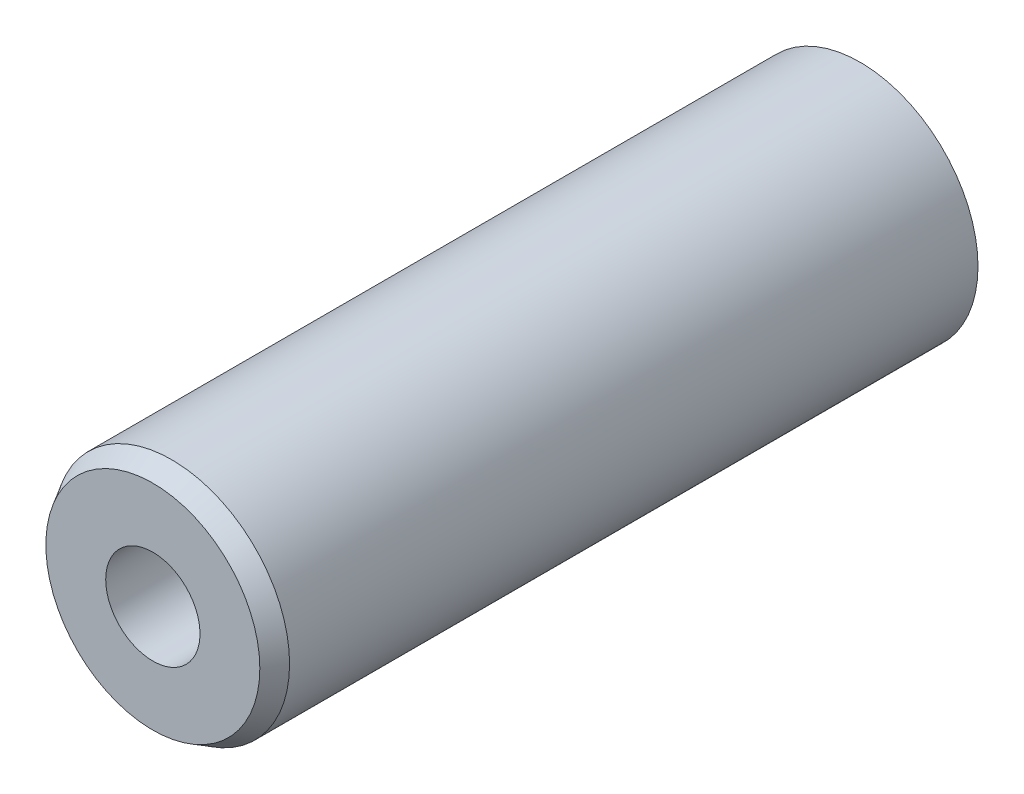
ISO-10303-21;
HEADER;
FILE_DESCRIPTION(('STEP AP214'),'2;1');
FILE_NAME('part.step','',(''),(''),'','','');
FILE_SCHEMA(('AUTOMOTIVE_DESIGN { 1 0 10303 214 1 1 1 1 }'));
ENDSEC;
DATA;
#1=APPLICATION_CONTEXT('core data for automotive mechanical design processes');
#2=APPLICATION_PROTOCOL_DEFINITION('international standard','automotive_design',2000,#1);
#3=PRODUCT_CONTEXT('',#1,'mechanical');
#4=PRODUCT('Part','Part','',(#3));
#5=PRODUCT_RELATED_PRODUCT_CATEGORY('part','',(#4));
#6=PRODUCT_DEFINITION_FORMATION('','',#4);
#7=PRODUCT_DEFINITION_CONTEXT('part definition',#1,'design');
#8=PRODUCT_DEFINITION('design','',#6,#7);
#9=PRODUCT_DEFINITION_SHAPE('','',#8);
#10=(LENGTH_UNIT() NAMED_UNIT(*) SI_UNIT(.MILLI.,.METRE.));
#11=(NAMED_UNIT(*) PLANE_ANGLE_UNIT() SI_UNIT($,.RADIAN.));
#12=(NAMED_UNIT(*) SI_UNIT($,.STERADIAN.) SOLID_ANGLE_UNIT());
#13=UNCERTAINTY_MEASURE_WITH_UNIT(LENGTH_MEASURE(1.E-05),#10,'distance_accuracy_value','');
#14=(GEOMETRIC_REPRESENTATION_CONTEXT(3) GLOBAL_UNCERTAINTY_ASSIGNED_CONTEXT((#13)) GLOBAL_UNIT_ASSIGNED_CONTEXT((#10,
#11,#12)) REPRESENTATION_CONTEXT('',''));
#15=CARTESIAN_POINT('',(0.,0.,0.));
#16=DIRECTION('',(0.,0.,1.));
#17=DIRECTION('',(1.,0.,0.));
#18=AXIS2_PLACEMENT_3D('',#15,#16,#17);
#19=CARTESIAN_POINT('',(0.,0.,15.));
#20=DIRECTION('',(0.,0.,-1.));
#21=DIRECTION('',(-1.,0.,0.));
#22=AXIS2_PLACEMENT_3D('',#19,#20,#21);
#23=CYLINDRICAL_SURFACE('',#22,2.5);
#24=CARTESIAN_POINT('',(0.,0.,14.6));
#25=DIRECTION('',(0.,0.,1.));
#26=DIRECTION('',(1.,0.,0.));
#27=AXIS2_PLACEMENT_3D('',#24,#25,#26);
#28=CIRCLE('',#27,2.5);
#29=CARTESIAN_POINT('',(2.5,0.,14.6));
#30=VERTEX_POINT('',#29);
#31=EDGE_CURVE('E42',#30,#30,#28,.F.);
#32=ORIENTED_EDGE('',*,*,#31,.T.);
#33=EDGE_LOOP('',(#32));
#34=FACE_BOUND('',#33,.T.);
#35=CARTESIAN_POINT('',(0.,0.,0.));
#36=DIRECTION('',(0.,0.,1.));
#37=DIRECTION('',(1.,0.,0.));
#38=AXIS2_PLACEMENT_3D('',#35,#36,#37);
#39=CIRCLE('',#38,2.5);
#40=CARTESIAN_POINT('',(2.5,0.,0.));
#41=VERTEX_POINT('',#40);
#42=EDGE_CURVE('E51',#41,#41,#39,.T.);
#43=ORIENTED_EDGE('',*,*,#42,.T.);
#44=EDGE_LOOP('',(#43));
#45=FACE_BOUND('',#44,.T.);
#46=ADVANCED_FACE('F31',(#34,#45),#23,.T.);
#47=CARTESIAN_POINT('',(0.,0.,15.));
#48=DIRECTION('',(0.,0.,1.));
#49=DIRECTION('',(1.,0.,0.));
#50=AXIS2_PLACEMENT_3D('',#47,#48,#49);
#51=PLANE('',#50);
#52=CARTESIAN_POINT('',(0.,0.,15.));
#53=DIRECTION('',(0.,0.,1.));
#54=DIRECTION('',(1.,0.,0.));
#55=AXIS2_PLACEMENT_3D('',#52,#53,#54);
#56=CIRCLE('',#55,2.26905989232415);
#57=CARTESIAN_POINT('',(2.26905989232415,0.,15.));
#58=VERTEX_POINT('',#57);
#59=EDGE_CURVE('E46',#58,#58,#56,.T.);
#60=ORIENTED_EDGE('',*,*,#59,.T.);
#61=EDGE_LOOP('',(#60));
#62=FACE_BOUND('',#61,.T.);
#63=CARTESIAN_POINT('',(0.,0.,15.));
#64=DIRECTION('',(0.,0.,-1.));
#65=DIRECTION('',(-1.,0.,0.));
#66=AXIS2_PLACEMENT_3D('',#63,#64,#65);
#67=CIRCLE('',#66,1.);
#68=CARTESIAN_POINT('',(-1.,0.,15.));
#69=VERTEX_POINT('',#68);
#70=EDGE_CURVE('E55',#69,#69,#67,.T.);
#71=ORIENTED_EDGE('',*,*,#70,.T.);
#72=EDGE_LOOP('',(#71));
#73=FACE_BOUND('',#72,.T.);
#74=ADVANCED_FACE('F79',(#62,#73),#51,.T.);
#75=CARTESIAN_POINT('',(0.,0.,0.));
#76=DIRECTION('',(0.,0.,1.));
#77=DIRECTION('',(1.,0.,0.));
#78=AXIS2_PLACEMENT_3D('',#75,#76,#77);
#79=PLANE('',#78);
#80=CARTESIAN_POINT('',(0.,0.,0.));
#81=DIRECTION('',(0.,0.,1.));
#82=DIRECTION('',(1.,0.,0.));
#83=AXIS2_PLACEMENT_3D('',#80,#81,#82);
#84=CIRCLE('',#83,1.64999999999999);
#85=CARTESIAN_POINT('',(1.64999999999999,0.,0.));
#86=VERTEX_POINT('',#85);
#87=EDGE_CURVE('E10',#86,#86,#84,.T.);
#88=ORIENTED_EDGE('',*,*,#87,.T.);
#89=EDGE_LOOP('',(#88));
#90=FACE_BOUND('',#89,.T.);
#91=ORIENTED_EDGE('',*,*,#42,.F.);
#92=EDGE_LOOP('',(#91));
#93=FACE_BOUND('',#92,.T.);
#94=ADVANCED_FACE('F85',(#90,#93),#79,.F.);
#95=CARTESIAN_POINT('',(0.,0.,15.));
#96=DIRECTION('',(0.,0.,-1.));
#97=DIRECTION('',(-1.,0.,0.));
#98=AXIS2_PLACEMENT_3D('',#95,#96,#97);
#99=CYLINDRICAL_SURFACE('',#98,1.);
#100=CARTESIAN_POINT('',(0.,0.,11.1502151547569));
#101=DIRECTION('',(0.,0.,-1.));
#102=DIRECTION('',(-1.,0.,0.));
#103=AXIS2_PLACEMENT_3D('',#100,#101,#102);
#104=CIRCLE('',#103,1.);
#105=CARTESIAN_POINT('',(-1.,0.,11.1502151547569));
#106=VERTEX_POINT('',#105);
#107=EDGE_CURVE('E52',#106,#106,#104,.T.);
#108=ORIENTED_EDGE('',*,*,#107,.T.);
#109=EDGE_LOOP('',(#108));
#110=FACE_BOUND('',#109,.T.);
#111=ORIENTED_EDGE('',*,*,#70,.F.);
#112=EDGE_LOOP('',(#111));
#113=FACE_BOUND('',#112,.T.);
#114=ADVANCED_FACE('F76',(#110,#113),#99,.F.);
#115=CARTESIAN_POINT('',(0.,0.,11.));
#116=DIRECTION('',(0.,0.,-1.));
#117=DIRECTION('',(-1.,0.,0.));
#118=AXIS2_PLACEMENT_3D('',#115,#116,#117);
#119=CONICAL_SURFACE('',#118,1.25,1.02974425867665);
#120=CARTESIAN_POINT('',(0.,0.,11.));
#121=DIRECTION('',(0.,0.,-1.));
#122=DIRECTION('',(-1.,0.,0.));
#123=AXIS2_PLACEMENT_3D('',#120,#121,#122);
#124=CIRCLE('',#123,1.25);
#125=CARTESIAN_POINT('',(-1.25,0.,11.));
#126=VERTEX_POINT('',#125);
#127=EDGE_CURVE('E56',#126,#126,#124,.T.);
#128=ORIENTED_EDGE('',*,*,#127,.T.);
#129=EDGE_LOOP('',(#128));
#130=FACE_BOUND('',#129,.T.);
#131=ORIENTED_EDGE('',*,*,#107,.F.);
#132=EDGE_LOOP('',(#131));
#133=FACE_BOUND('',#132,.T.);
#134=ADVANCED_FACE('F64',(#130,#133),#119,.F.);
#135=CARTESIAN_POINT('',(0.,0.,0.));
#136=DIRECTION('',(0.,0.,-1.));
#137=DIRECTION('',(-1.,0.,0.));
#138=AXIS2_PLACEMENT_3D('',#135,#136,#137);
#139=CYLINDRICAL_SURFACE('',#138,1.24999999999999);
#140=CARTESIAN_POINT('',(0.,0.,0.692820323027538));
#141=DIRECTION('',(0.,0.,1.));
#142=DIRECTION('',(1.,0.,0.));
#143=AXIS2_PLACEMENT_3D('',#140,#141,#142);
#144=CIRCLE('',#143,1.24999999999999);
#145=CARTESIAN_POINT('',(1.24999999999999,0.,0.692820323027538));
#146=VERTEX_POINT('',#145);
#147=EDGE_CURVE('E38',#146,#146,#144,.F.);
#148=ORIENTED_EDGE('',*,*,#147,.T.);
#149=EDGE_LOOP('',(#148));
#150=FACE_BOUND('',#149,.T.);
#151=ORIENTED_EDGE('',*,*,#127,.F.);
#152=EDGE_LOOP('',(#151));
#153=FACE_BOUND('',#152,.T.);
#154=ADVANCED_FACE('F67',(#150,#153),#139,.F.);
#155=CARTESIAN_POINT('',(0.,0.,15.));
#156=DIRECTION('',(0.,0.,-1.));
#157=DIRECTION('',(-1.,0.,0.));
#158=AXIS2_PLACEMENT_3D('',#155,#156,#157);
#159=CONICAL_SURFACE('',#158,2.26905989232415,0.523598775598297);
#160=ORIENTED_EDGE('',*,*,#31,.F.);
#161=EDGE_LOOP('',(#160));
#162=FACE_BOUND('',#161,.T.);
#163=ORIENTED_EDGE('',*,*,#59,.F.);
#164=EDGE_LOOP('',(#163));
#165=FACE_BOUND('',#164,.T.);
#166=ADVANCED_FACE('F69',(#162,#165),#159,.T.);
#167=CARTESIAN_POINT('',(0.,0.,0.692820323027538));
#168=DIRECTION('',(0.,0.,-1.));
#169=DIRECTION('',(-1.,0.,0.));
#170=AXIS2_PLACEMENT_3D('',#167,#168,#169);
#171=CONICAL_SURFACE('',#170,1.24999999999999,0.5235987755983);
#172=ORIENTED_EDGE('',*,*,#87,.F.);
#173=EDGE_LOOP('',(#172));
#174=FACE_BOUND('',#173,.T.);
#175=ORIENTED_EDGE('',*,*,#147,.F.);
#176=EDGE_LOOP('',(#175));
#177=FACE_BOUND('',#176,.T.);
#178=ADVANCED_FACE('F33',(#174,#177),#171,.F.);
#179=CLOSED_SHELL('',(#46,#74,#94,#114,#134,#154,#166,#178));
#180=MANIFOLD_SOLID_BREP('B2',#179);
#181=ADVANCED_BREP_SHAPE_REPRESENTATION('',(#18,#180),#14);
#182=SHAPE_DEFINITION_REPRESENTATION(#9,#181);
ENDSEC;
END-ISO-10303-21;
